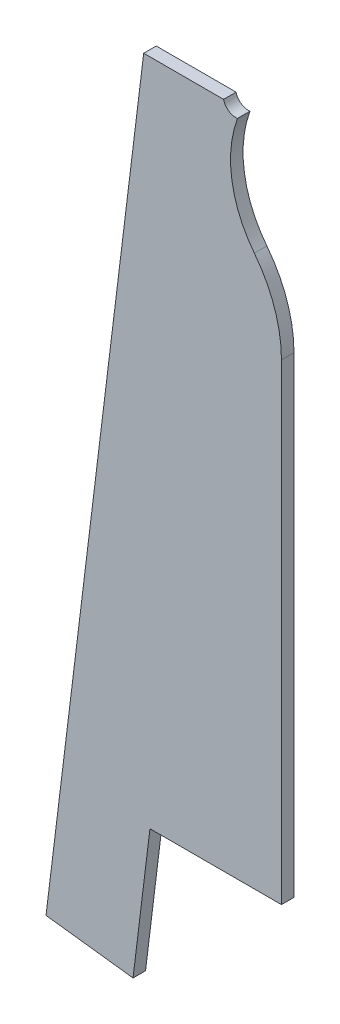
ISO-10303-21;
HEADER;
FILE_DESCRIPTION(('STEP AP214'),'2;1');
FILE_NAME('part.step','',(''),(''),'','','');
FILE_SCHEMA(('AUTOMOTIVE_DESIGN { 1 0 10303 214 1 1 1 1 }'));
ENDSEC;
DATA;
#1=APPLICATION_CONTEXT('core data for automotive mechanical design processes');
#2=APPLICATION_PROTOCOL_DEFINITION('international standard','automotive_design',2000,#1);
#3=PRODUCT_CONTEXT('',#1,'mechanical');
#4=PRODUCT('Part','Part','',(#3));
#5=PRODUCT_RELATED_PRODUCT_CATEGORY('part','',(#4));
#6=PRODUCT_DEFINITION_FORMATION('','',#4);
#7=PRODUCT_DEFINITION_CONTEXT('part definition',#1,'design');
#8=PRODUCT_DEFINITION('design','',#6,#7);
#9=PRODUCT_DEFINITION_SHAPE('','',#8);
#10=(LENGTH_UNIT() NAMED_UNIT(*) SI_UNIT(.MILLI.,.METRE.));
#11=(NAMED_UNIT(*) PLANE_ANGLE_UNIT() SI_UNIT($,.RADIAN.));
#12=(NAMED_UNIT(*) SI_UNIT($,.STERADIAN.) SOLID_ANGLE_UNIT());
#13=UNCERTAINTY_MEASURE_WITH_UNIT(LENGTH_MEASURE(1.E-05),#10,'distance_accuracy_value','');
#14=(GEOMETRIC_REPRESENTATION_CONTEXT(3) GLOBAL_UNCERTAINTY_ASSIGNED_CONTEXT((#13)) GLOBAL_UNIT_ASSIGNED_CONTEXT((#10,
#11,#12)) REPRESENTATION_CONTEXT('',''));
#15=CARTESIAN_POINT('',(0.,0.,0.));
#16=DIRECTION('',(0.,0.,1.));
#17=DIRECTION('',(1.,0.,0.));
#18=AXIS2_PLACEMENT_3D('',#15,#16,#17);
#19=CARTESIAN_POINT('',(95.7641730209773,95.7470621344799,6.35));
#20=DIRECTION('',(-1.,0.,0.));
#21=DIRECTION('',(0.,-1.,0.));
#22=AXIS2_PLACEMENT_3D('',#19,#20,#21);
#23=PLANE('',#22);
#24=DIRECTION('',(0.,0.,1.));
#25=VECTOR('',#24,1.);
#26=CARTESIAN_POINT('',(95.764173020977,334.935994433782,0.));
#27=LINE('',#26,#25);
#28=CARTESIAN_POINT('',(95.764173020977,334.935994433782,0.));
#29=VERTEX_POINT('',#28);
#30=CARTESIAN_POINT('',(95.764173020977,334.935994433782,6.35));
#31=VERTEX_POINT('',#30);
#32=EDGE_CURVE('E161',#29,#31,#27,.T.);
#33=ORIENTED_EDGE('',*,*,#32,.T.);
#34=DIRECTION('',(0.,1.,0.));
#35=VECTOR('',#34,1.);
#36=CARTESIAN_POINT('',(95.7641730209773,95.7470621344799,6.35));
#37=LINE('',#36,#35);
#38=CARTESIAN_POINT('',(95.7641730209773,95.7470621344799,6.35));
#39=VERTEX_POINT('',#38);
#40=EDGE_CURVE('E109',#39,#31,#37,.T.);
#41=ORIENTED_EDGE('',*,*,#40,.F.);
#42=DIRECTION('',(0.,0.,-1.));
#43=VECTOR('',#42,1.);
#44=CARTESIAN_POINT('',(95.7641730209773,95.7470621344799,6.35));
#45=LINE('',#44,#43);
#46=CARTESIAN_POINT('',(95.7641730209773,95.7470621344799,0.));
#47=VERTEX_POINT('',#46);
#48=EDGE_CURVE('E118',#39,#47,#45,.T.);
#49=ORIENTED_EDGE('',*,*,#48,.T.);
#50=DIRECTION('',(0.,1.,0.));
#51=VECTOR('',#50,1.);
#52=CARTESIAN_POINT('',(95.7641730209773,95.7470621344799,0.));
#53=LINE('',#52,#51);
#54=EDGE_CURVE('E133',#47,#29,#53,.T.);
#55=ORIENTED_EDGE('',*,*,#54,.T.);
#56=EDGE_LOOP('',(#33,#41,#49,#55));
#57=FACE_BOUND('',#56,.T.);
#58=ADVANCED_FACE('F34',(#57),#23,.F.);
#59=CARTESIAN_POINT('',(29.081649880651,95.7470621344798,6.35));
#60=DIRECTION('',(-0.992546151641323,0.121869343405143,0.));
#61=DIRECTION('',(-0.121869343405143,-0.992546151641323,0.));
#62=AXIS2_PLACEMENT_3D('',#59,#60,#61);
#63=PLANE('',#62);
#64=DIRECTION('',(0.121869343405143,0.992546151641323,0.));
#65=VECTOR('',#64,1.);
#66=CARTESIAN_POINT('',(29.081649880651,95.7470621344798,0.));
#67=LINE('',#66,#65);
#68=CARTESIAN_POINT('',(20.5051483015834,25.8970621344799,0.));
#69=VERTEX_POINT('',#68);
#70=CARTESIAN_POINT('',(29.081649880651,95.7470621344798,0.));
#71=VERTEX_POINT('',#70);
#72=EDGE_CURVE('E127',#69,#71,#67,.T.);
#73=ORIENTED_EDGE('',*,*,#72,.T.);
#74=DIRECTION('',(0.,0.,-1.));
#75=VECTOR('',#74,1.);
#76=CARTESIAN_POINT('',(29.081649880651,95.7470621344798,6.35));
#77=LINE('',#76,#75);
#78=CARTESIAN_POINT('',(29.081649880651,95.7470621344798,6.35));
#79=VERTEX_POINT('',#78);
#80=EDGE_CURVE('E42',#79,#71,#77,.T.);
#81=ORIENTED_EDGE('',*,*,#80,.F.);
#82=DIRECTION('',(0.121869343405143,0.992546151641323,0.));
#83=VECTOR('',#82,1.);
#84=CARTESIAN_POINT('',(29.081649880651,95.7470621344798,6.35));
#85=LINE('',#84,#83);
#86=CARTESIAN_POINT('',(20.5051483015834,25.8970621344799,6.35));
#87=VERTEX_POINT('',#86);
#88=EDGE_CURVE('E140',#87,#79,#85,.T.);
#89=ORIENTED_EDGE('',*,*,#88,.F.);
#90=DIRECTION('',(0.,0.,-1.));
#91=VECTOR('',#90,1.);
#92=CARTESIAN_POINT('',(20.5051483015834,25.8970621344799,6.35));
#93=LINE('',#92,#91);
#94=EDGE_CURVE('E123',#87,#69,#93,.T.);
#95=ORIENTED_EDGE('',*,*,#94,.T.);
#96=EDGE_LOOP('',(#73,#81,#89,#95));
#97=FACE_BOUND('',#96,.T.);
#98=ADVANCED_FACE('F36',(#97),#63,.F.);
#99=CARTESIAN_POINT('',(95.7641730209773,95.7470621344799,6.35));
#100=DIRECTION('',(0.,1.,0.));
#101=DIRECTION('',(-1.,0.,0.));
#102=AXIS2_PLACEMENT_3D('',#99,#100,#101);
#103=PLANE('',#102);
#104=DIRECTION('',(1.,0.,0.));
#105=VECTOR('',#104,1.);
#106=CARTESIAN_POINT('',(95.7641730209773,95.7470621344799,0.));
#107=LINE('',#106,#105);
#108=EDGE_CURVE('E130',#71,#47,#107,.T.);
#109=ORIENTED_EDGE('',*,*,#108,.T.);
#110=ORIENTED_EDGE('',*,*,#48,.F.);
#111=DIRECTION('',(1.,0.,0.));
#112=VECTOR('',#111,1.);
#113=CARTESIAN_POINT('',(95.7641730209773,95.7470621344799,6.35));
#114=LINE('',#113,#112);
#115=EDGE_CURVE('E90',#79,#39,#114,.T.);
#116=ORIENTED_EDGE('',*,*,#115,.F.);
#117=ORIENTED_EDGE('',*,*,#80,.T.);
#118=EDGE_LOOP('',(#109,#110,#116,#117));
#119=FACE_BOUND('',#118,.T.);
#120=ADVANCED_FACE('F145',(#119),#103,.F.);
#121=CARTESIAN_POINT('',(25.9141730209772,434.684910475872,6.35));
#122=DIRECTION('',(0.,-1.,0.));
#123=DIRECTION('',(1.,0.,0.));
#124=AXIS2_PLACEMENT_3D('',#121,#122,#123);
#125=PLANE('',#124);
#126=DIRECTION('',(-1.,0.,0.));
#127=VECTOR('',#126,1.);
#128=CARTESIAN_POINT('',(25.9141730209772,434.684910475872,6.35));
#129=LINE('',#128,#127);
#130=CARTESIAN_POINT('',(66.412753154869,434.684910475872,6.35));
#131=VERTEX_POINT('',#130);
#132=CARTESIAN_POINT('',(25.9141730209772,434.684910475872,6.35));
#133=VERTEX_POINT('',#132);
#134=EDGE_CURVE('E97',#131,#133,#129,.T.);
#135=ORIENTED_EDGE('',*,*,#134,.F.);
#136=DIRECTION('',(0.,0.,1.));
#137=VECTOR('',#136,1.);
#138=CARTESIAN_POINT('',(66.412753154869,434.684910475872,0.));
#139=LINE('',#138,#137);
#140=CARTESIAN_POINT('',(66.412753154869,434.684910475872,0.));
#141=VERTEX_POINT('',#140);
#142=EDGE_CURVE('E131',#131,#141,#139,.F.);
#143=ORIENTED_EDGE('',*,*,#142,.T.);
#144=DIRECTION('',(-1.,0.,0.));
#145=VECTOR('',#144,1.);
#146=CARTESIAN_POINT('',(25.9141730209772,434.684910475872,0.));
#147=LINE('',#146,#145);
#148=CARTESIAN_POINT('',(25.9141730209772,434.684910475872,0.));
#149=VERTEX_POINT('',#148);
#150=EDGE_CURVE('E115',#141,#149,#147,.T.);
#151=ORIENTED_EDGE('',*,*,#150,.T.);
#152=DIRECTION('',(0.,0.,-1.));
#153=VECTOR('',#152,1.);
#154=CARTESIAN_POINT('',(25.9141730209772,434.684910475872,6.35));
#155=LINE('',#154,#153);
#156=EDGE_CURVE('E112',#133,#149,#155,.T.);
#157=ORIENTED_EDGE('',*,*,#156,.F.);
#158=EDGE_LOOP('',(#135,#143,#151,#157));
#159=FACE_BOUND('',#158,.T.);
#160=ADVANCED_FACE('F113',(#159),#125,.F.);
#161=CARTESIAN_POINT('',(-23.6135281388733,31.3141544488385,6.35));
#162=DIRECTION('',(0.992546151641322,-0.121869343405144,0.));
#163=DIRECTION('',(0.121869343405144,0.992546151641322,0.));
#164=AXIS2_PLACEMENT_3D('',#161,#162,#163);
#165=PLANE('',#164);
#166=DIRECTION('',(-0.121869343405144,-0.992546151641322,0.));
#167=VECTOR('',#166,1.);
#168=CARTESIAN_POINT('',(-23.6135281388733,31.3141544488385,0.));
#169=LINE('',#168,#167);
#170=CARTESIAN_POINT('',(-23.6135281388733,31.3141544488385,0.));
#171=VERTEX_POINT('',#170);
#172=EDGE_CURVE('E137',#149,#171,#169,.T.);
#173=ORIENTED_EDGE('',*,*,#172,.T.);
#174=DIRECTION('',(0.,0.,-1.));
#175=VECTOR('',#174,1.);
#176=CARTESIAN_POINT('',(-23.6135281388733,31.3141544488385,6.35));
#177=LINE('',#176,#175);
#178=CARTESIAN_POINT('',(-23.6135281388733,31.3141544488385,6.35));
#179=VERTEX_POINT('',#178);
#180=EDGE_CURVE('E119',#179,#171,#177,.T.);
#181=ORIENTED_EDGE('',*,*,#180,.F.);
#182=DIRECTION('',(-0.121869343405144,-0.992546151641322,0.));
#183=VECTOR('',#182,1.);
#184=CARTESIAN_POINT('',(-23.6135281388733,31.3141544488385,6.35));
#185=LINE('',#184,#183);
#186=EDGE_CURVE('E102',#133,#179,#185,.T.);
#187=ORIENTED_EDGE('',*,*,#186,.F.);
#188=ORIENTED_EDGE('',*,*,#156,.T.);
#189=EDGE_LOOP('',(#173,#181,#187,#188));
#190=FACE_BOUND('',#189,.T.);
#191=ADVANCED_FACE('F121',(#190),#165,.F.);
#192=CARTESIAN_POINT('',(20.5051483015834,25.8970621344799,6.35));
#193=DIRECTION('',(0.121869343405143,0.992546151641323,0.));
#194=DIRECTION('',(-0.992546151641323,0.121869343405143,0.));
#195=AXIS2_PLACEMENT_3D('',#192,#193,#194);
#196=PLANE('',#195);
#197=DIRECTION('',(0.992546151641323,-0.121869343405143,0.));
#198=VECTOR('',#197,1.);
#199=CARTESIAN_POINT('',(20.5051483015834,25.8970621344799,0.));
#200=LINE('',#199,#198);
#201=EDGE_CURVE('E81',#171,#69,#200,.T.);
#202=ORIENTED_EDGE('',*,*,#201,.T.);
#203=ORIENTED_EDGE('',*,*,#94,.F.);
#204=DIRECTION('',(0.992546151641323,-0.121869343405143,0.));
#205=VECTOR('',#204,1.);
#206=CARTESIAN_POINT('',(20.5051483015834,25.8970621344799,6.35));
#207=LINE('',#206,#205);
#208=EDGE_CURVE('E57',#179,#87,#207,.T.);
#209=ORIENTED_EDGE('',*,*,#208,.F.);
#210=ORIENTED_EDGE('',*,*,#180,.T.);
#211=EDGE_LOOP('',(#202,#203,#209,#210));
#212=FACE_BOUND('',#211,.T.);
#213=ADVANCED_FACE('F198',(#212),#196,.F.);
#214=CARTESIAN_POINT('',(0.,0.,6.35));
#215=DIRECTION('',(0.,0.,-1.));
#216=DIRECTION('',(-1.,0.,0.));
#217=AXIS2_PLACEMENT_3D('',#214,#215,#216);
#218=PLANE('',#217);
#219=CARTESIAN_POINT('',(30.6766730209772,334.935994433785,6.35));
#220=DIRECTION('',(0.,0.,-1.));
#221=DIRECTION('',(-1.,0.,0.));
#222=AXIS2_PLACEMENT_3D('',#219,#220,#221);
#223=CIRCLE('',#222,65.0874999999998);
#224=CARTESIAN_POINT('',(82.0161598908015,374.943990436998,6.35));
#225=VERTEX_POINT('',#224);
#226=EDGE_CURVE('E186',#225,#31,#223,.T.);
#227=ORIENTED_EDGE('',*,*,#226,.F.);
#228=CARTESIAN_POINT('',(127.09473372772,410.072962537381,6.35));
#229=DIRECTION('',(0.,0.,1.));
#230=DIRECTION('',(1.,0.,0.));
#231=AXIS2_PLACEMENT_3D('',#228,#229,#230);
#232=CIRCLE('',#231,57.15);
#233=CARTESIAN_POINT('',(73.4745637946522,429.846679344013,6.35));
#234=VERTEX_POINT('',#233);
#235=EDGE_CURVE('E187',#234,#225,#232,.T.);
#236=ORIENTED_EDGE('',*,*,#235,.F.);
#237=CARTESIAN_POINT('',(72.594859493668,436.13544872624,6.35));
#238=DIRECTION('',(0.,0.,1.));
#239=DIRECTION('',(1.,0.,0.));
#240=AXIS2_PLACEMENT_3D('',#237,#238,#239);
#241=CIRCLE('',#240,6.34999999999999);
#242=EDGE_CURVE('E106',#131,#234,#241,.T.);
#243=ORIENTED_EDGE('',*,*,#242,.F.);
#244=ORIENTED_EDGE('',*,*,#134,.T.);
#245=ORIENTED_EDGE('',*,*,#186,.T.);
#246=ORIENTED_EDGE('',*,*,#208,.T.);
#247=ORIENTED_EDGE('',*,*,#88,.T.);
#248=ORIENTED_EDGE('',*,*,#115,.T.);
#249=ORIENTED_EDGE('',*,*,#40,.T.);
#250=EDGE_LOOP('',(#227,#236,#243,#244,#245,#246,#247,#248,#249));
#251=FACE_BOUND('',#250,.T.);
#252=ADVANCED_FACE('F100',(#251),#218,.F.);
#253=CARTESIAN_POINT('',(0.,0.,0.));
#254=DIRECTION('',(0.,0.,-1.));
#255=DIRECTION('',(-1.,0.,0.));
#256=AXIS2_PLACEMENT_3D('',#253,#254,#255);
#257=PLANE('',#256);
#258=CARTESIAN_POINT('',(127.09473372772,410.072962537381,0.));
#259=DIRECTION('',(0.,0.,1.));
#260=DIRECTION('',(1.,0.,0.));
#261=AXIS2_PLACEMENT_3D('',#258,#259,#260);
#262=CIRCLE('',#261,57.15);
#263=CARTESIAN_POINT('',(73.4745637946522,429.846679344013,0.));
#264=VERTEX_POINT('',#263);
#265=CARTESIAN_POINT('',(82.0161598908015,374.943990436998,0.));
#266=VERTEX_POINT('',#265);
#267=EDGE_CURVE('E49',#264,#266,#262,.T.);
#268=ORIENTED_EDGE('',*,*,#267,.T.);
#269=CARTESIAN_POINT('',(30.6766730209772,334.935994433785,0.));
#270=DIRECTION('',(0.,0.,-1.));
#271=DIRECTION('',(-1.,0.,0.));
#272=AXIS2_PLACEMENT_3D('',#269,#270,#271);
#273=CIRCLE('',#272,65.0874999999998);
#274=EDGE_CURVE('E155',#266,#29,#273,.T.);
#275=ORIENTED_EDGE('',*,*,#274,.T.);
#276=ORIENTED_EDGE('',*,*,#54,.F.);
#277=ORIENTED_EDGE('',*,*,#108,.F.);
#278=ORIENTED_EDGE('',*,*,#72,.F.);
#279=ORIENTED_EDGE('',*,*,#201,.F.);
#280=ORIENTED_EDGE('',*,*,#172,.F.);
#281=ORIENTED_EDGE('',*,*,#150,.F.);
#282=CARTESIAN_POINT('',(72.594859493668,436.13544872624,0.));
#283=DIRECTION('',(0.,0.,1.));
#284=DIRECTION('',(1.,0.,0.));
#285=AXIS2_PLACEMENT_3D('',#282,#283,#284);
#286=CIRCLE('',#285,6.34999999999999);
#287=EDGE_CURVE('E179',#141,#264,#286,.T.);
#288=ORIENTED_EDGE('',*,*,#287,.T.);
#289=EDGE_LOOP('',(#268,#275,#276,#277,#278,#279,#280,#281,#288));
#290=FACE_BOUND('',#289,.T.);
#291=ADVANCED_FACE('F150',(#290),#257,.T.);
#292=CARTESIAN_POINT('',(72.594859493668,436.13544872624,0.));
#293=DIRECTION('',(0.,0.,1.));
#294=DIRECTION('',(1.,0.,0.));
#295=AXIS2_PLACEMENT_3D('',#292,#293,#294);
#296=CYLINDRICAL_SURFACE('',#295,6.34999999999999);
#297=ORIENTED_EDGE('',*,*,#242,.T.);
#298=DIRECTION('',(0.,0.,1.));
#299=VECTOR('',#298,1.);
#300=CARTESIAN_POINT('',(73.4745637946522,429.846679344013,3.175));
#301=LINE('',#300,#299);
#302=EDGE_CURVE('E11',#234,#264,#301,.F.);
#303=ORIENTED_EDGE('',*,*,#302,.T.);
#304=ORIENTED_EDGE('',*,*,#287,.F.);
#305=ORIENTED_EDGE('',*,*,#142,.F.);
#306=EDGE_LOOP('',(#297,#303,#304,#305));
#307=FACE_BOUND('',#306,.T.);
#308=ADVANCED_FACE('F180',(#307),#296,.F.);
#309=CARTESIAN_POINT('',(127.09473372772,410.072962537381,0.));
#310=DIRECTION('',(0.,0.,1.));
#311=DIRECTION('',(1.,0.,0.));
#312=AXIS2_PLACEMENT_3D('',#309,#310,#311);
#313=CYLINDRICAL_SURFACE('',#312,57.15);
#314=ORIENTED_EDGE('',*,*,#235,.T.);
#315=DIRECTION('',(0.,0.,1.));
#316=VECTOR('',#315,1.);
#317=CARTESIAN_POINT('',(82.0161598908015,374.943990436998,0.));
#318=LINE('',#317,#316);
#319=EDGE_CURVE('E195',#266,#225,#318,.T.);
#320=ORIENTED_EDGE('',*,*,#319,.F.);
#321=ORIENTED_EDGE('',*,*,#267,.F.);
#322=ORIENTED_EDGE('',*,*,#302,.F.);
#323=EDGE_LOOP('',(#314,#320,#321,#322));
#324=FACE_BOUND('',#323,.T.);
#325=ADVANCED_FACE('F197',(#324),#313,.F.);
#326=CARTESIAN_POINT('',(30.6766730209772,334.935994433785,0.));
#327=DIRECTION('',(0.,0.,1.));
#328=DIRECTION('',(1.,0.,0.));
#329=AXIS2_PLACEMENT_3D('',#326,#327,#328);
#330=CYLINDRICAL_SURFACE('',#329,65.0874999999998);
#331=ORIENTED_EDGE('',*,*,#226,.T.);
#332=ORIENTED_EDGE('',*,*,#32,.F.);
#333=ORIENTED_EDGE('',*,*,#274,.F.);
#334=ORIENTED_EDGE('',*,*,#319,.T.);
#335=EDGE_LOOP('',(#331,#332,#333,#334));
#336=FACE_BOUND('',#335,.T.);
#337=ADVANCED_FACE('F196',(#336),#330,.T.);
#338=CLOSED_SHELL('',(#58,#98,#120,#160,#191,#213,#252,#291,#308,#325,#337));
#339=MANIFOLD_SOLID_BREP('B2',#338);
#340=ADVANCED_BREP_SHAPE_REPRESENTATION('',(#18,#339),#14);
#341=SHAPE_DEFINITION_REPRESENTATION(#9,#340);
ENDSEC;
END-ISO-10303-21;
